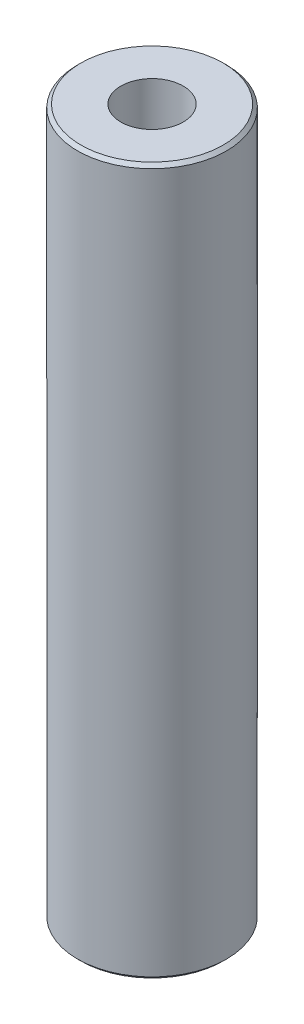
ISO-10303-21;
HEADER;
FILE_DESCRIPTION(('STEP AP214'),'2;1');
FILE_NAME('part.step','',(''),(''),'','','');
FILE_SCHEMA(('AUTOMOTIVE_DESIGN { 1 0 10303 214 1 1 1 1 }'));
ENDSEC;
DATA;
#1=APPLICATION_CONTEXT('core data for automotive mechanical design processes');
#2=APPLICATION_PROTOCOL_DEFINITION('international standard','automotive_design',2000,#1);
#3=PRODUCT_CONTEXT('',#1,'mechanical');
#4=PRODUCT('Part','Part','',(#3));
#5=PRODUCT_RELATED_PRODUCT_CATEGORY('part','',(#4));
#6=PRODUCT_DEFINITION_FORMATION('','',#4);
#7=PRODUCT_DEFINITION_CONTEXT('part definition',#1,'design');
#8=PRODUCT_DEFINITION('design','',#6,#7);
#9=PRODUCT_DEFINITION_SHAPE('','',#8);
#10=(LENGTH_UNIT() NAMED_UNIT(*) SI_UNIT(.MILLI.,.METRE.));
#11=(NAMED_UNIT(*) PLANE_ANGLE_UNIT() SI_UNIT($,.RADIAN.));
#12=(NAMED_UNIT(*) SI_UNIT($,.STERADIAN.) SOLID_ANGLE_UNIT());
#13=UNCERTAINTY_MEASURE_WITH_UNIT(LENGTH_MEASURE(1.E-05),#10,'distance_accuracy_value','');
#14=(GEOMETRIC_REPRESENTATION_CONTEXT(3) GLOBAL_UNCERTAINTY_ASSIGNED_CONTEXT((#13)) GLOBAL_UNIT_ASSIGNED_CONTEXT((#10,
#11,#12)) REPRESENTATION_CONTEXT('',''));
#15=CARTESIAN_POINT('',(0.,0.,0.));
#16=DIRECTION('',(0.,0.,1.));
#17=DIRECTION('',(1.,0.,0.));
#18=AXIS2_PLACEMENT_3D('',#15,#16,#17);
#19=CARTESIAN_POINT('',(0.,94.8356356416576,0.));
#20=DIRECTION('',(0.,-1.,0.));
#21=DIRECTION('',(0.,0.,-1.));
#22=AXIS2_PLACEMENT_3D('',#19,#20,#21);
#23=CYLINDRICAL_SURFACE('',#22,10.);
#24=CARTESIAN_POINT('',(0.,94.3852052418694,0.));
#25=DIRECTION('',(0.,1.,0.));
#26=DIRECTION('',(0.,0.,1.));
#27=AXIS2_PLACEMENT_3D('',#24,#25,#26);
#28=CIRCLE('',#27,10.);
#29=CARTESIAN_POINT('',(0.,94.3852052418694,-10.));
#30=VERTEX_POINT('',#29);
#31=EDGE_CURVE('E50',#30,#30,#28,.F.);
#32=CARTESIAN_POINT('',(0.,0.45043039978826,0.));
#33=DIRECTION('',(0.,1.,0.));
#34=DIRECTION('',(0.,0.,1.));
#35=AXIS2_PLACEMENT_3D('',#32,#33,#34);
#36=CIRCLE('',#35,10.);
#37=CARTESIAN_POINT('',(0.,0.45043039978826,-10.));
#38=VERTEX_POINT('',#37);
#39=EDGE_CURVE('E51',#38,#38,#36,.T.);
#40=CARTESIAN_POINT('',(0.,94.3852052418694,-10.));
#41=CARTESIAN_POINT('',(0.,93.406718003931,-10.));
#42=CARTESIAN_POINT('',(0.,92.4282307659927,-10.));
#43=CARTESIAN_POINT('',(0.,90.471256290116,-10.));
#44=CARTESIAN_POINT('',(0.,89.4927690521776,-10.));
#45=CARTESIAN_POINT('',(0.,87.5357945763009,-10.));
#46=CARTESIAN_POINT('',(0.,86.5573073383626,-10.));
#47=CARTESIAN_POINT('',(0.,84.6003328624859,-10.));
#48=CARTESIAN_POINT('',(0.,83.6218456245476,-10.));
#49=CARTESIAN_POINT('',(0.,81.6648711486709,-10.));
#50=CARTESIAN_POINT('',(0.,80.6863839107325,-10.));
#51=CARTESIAN_POINT('',(0.,78.7294094348558,-10.));
#52=CARTESIAN_POINT('',(0.,77.7509221969175,-10.));
#53=CARTESIAN_POINT('',(0.,75.7939477210408,-10.));
#54=CARTESIAN_POINT('',(0.,74.8154604831025,-10.));
#55=CARTESIAN_POINT('',(0.,72.8584860072258,-10.));
#56=CARTESIAN_POINT('',(0.,71.8799987692874,-10.));
#57=CARTESIAN_POINT('',(0.,69.9230242934107,-10.));
#58=CARTESIAN_POINT('',(0.,68.9445370554724,-10.));
#59=CARTESIAN_POINT('',(0.,66.9875625795957,-10.));
#60=CARTESIAN_POINT('',(0.,66.0090753416574,-10.));
#61=CARTESIAN_POINT('',(0.,64.0521008657807,-10.));
#62=CARTESIAN_POINT('',(0.,63.0736136278423,-10.));
#63=CARTESIAN_POINT('',(0.,61.1166391519656,-10.));
#64=CARTESIAN_POINT('',(0.,60.1381519140273,-10.));
#65=CARTESIAN_POINT('',(0.,58.1811774381506,-10.));
#66=CARTESIAN_POINT('',(0.,57.2026902002123,-10.));
#67=CARTESIAN_POINT('',(0.,55.2457157243356,-10.));
#68=CARTESIAN_POINT('',(0.,54.2672284863972,-10.));
#69=CARTESIAN_POINT('',(0.,52.3102540105205,-10.));
#70=CARTESIAN_POINT('',(0.,51.3317667725822,-10.));
#71=CARTESIAN_POINT('',(0.,49.3747922967055,-10.));
#72=CARTESIAN_POINT('',(0.,48.3963050587671,-10.));
#73=CARTESIAN_POINT('',(0.,46.4393305828905,-10.));
#74=CARTESIAN_POINT('',(0.,45.4608433449521,-10.));
#75=CARTESIAN_POINT('',(0.,43.5038688690754,-10.));
#76=CARTESIAN_POINT('',(0.,42.5253816311371,-10.));
#77=CARTESIAN_POINT('',(0.,40.5684071552604,-10.));
#78=CARTESIAN_POINT('',(0.,39.589919917322,-10.));
#79=CARTESIAN_POINT('',(0.,37.6329454414454,-10.));
#80=CARTESIAN_POINT('',(0.,36.654458203507,-10.));
#81=CARTESIAN_POINT('',(0.,34.6974837276303,-10.));
#82=CARTESIAN_POINT('',(0.,33.718996489692,-10.));
#83=CARTESIAN_POINT('',(0.,31.7620220138153,-10.));
#84=CARTESIAN_POINT('',(0.,30.7835347758769,-10.));
#85=CARTESIAN_POINT('',(0.,28.8265603000002,-10.));
#86=CARTESIAN_POINT('',(0.,27.8480730620619,-10.));
#87=CARTESIAN_POINT('',(0.,25.8910985861852,-10.));
#88=CARTESIAN_POINT('',(0.,24.9126113482469,-10.));
#89=CARTESIAN_POINT('',(0.,22.9556368723702,-10.));
#90=CARTESIAN_POINT('',(0.,21.9771496344319,-10.));
#91=CARTESIAN_POINT('',(0.,20.0201751585552,-10.));
#92=CARTESIAN_POINT('',(0.,19.0416879206168,-10.));
#93=CARTESIAN_POINT('',(0.,17.0847134447401,-10.));
#94=CARTESIAN_POINT('',(0.,16.1062262068018,-10.));
#95=CARTESIAN_POINT('',(0.,14.1492517309251,-10.));
#96=CARTESIAN_POINT('',(0.,13.1707644929867,-10.));
#97=CARTESIAN_POINT('',(0.,11.2137900171101,-10.));
#98=CARTESIAN_POINT('',(0.,10.2353027791717,-10.));
#99=CARTESIAN_POINT('',(0.,8.27832830329502,-10.));
#100=CARTESIAN_POINT('',(0.,7.29984106535668,-10.));
#101=CARTESIAN_POINT('',(0.,5.34286658947998,-10.));
#102=CARTESIAN_POINT('',(0.,4.36437935154164,-10.));
#103=CARTESIAN_POINT('',(0.,2.40740487566495,-10.));
#104=CARTESIAN_POINT('',(0.,1.42891763772661,-10.));
#105=CARTESIAN_POINT('',(0.,0.45043039978826,-10.));
#106=B_SPLINE_CURVE_WITH_KNOTS('',3,(#40,#41,#42,#43,#44,#45,#46,#47,#48,#49,#50,#51,#52,#53,
#54,#55,#56,#57,#58,#59,#60,#61,#62,#63,#64,#65,#66,#67,#68,#69,#70,#71,#72,#73,#74,#75,#76,#77,
#78,#79,#80,#81,#82,#83,#84,#85,#86,#87,#88,#89,#90,#91,#92,#93,#94,#95,#96,#97,#98,#99,#100,
#101,#102,#103,#104,#105),.UNSPECIFIED.,.F.,.F.,(4,2,2,2,2,2,2,2,2,2,2,2,2,2,2,2,2,2,2,2,2,2,2,
2,2,2,2,2,2,2,2,2,4),(0.,2.93546171381504,5.87092342763007,8.80638514144511,11.7418468552601,
14.6773085690752,17.6127702828902,20.5482319967052,23.4836937105203,26.4191554243353,
29.3546171381504,32.2900788519654,35.2255405657804,38.1610022795955,41.0964639934105,
44.0319257072255,46.9673874210406,49.9028491348556,52.8383108486706,55.7737725624857,
58.7092342763007,61.6446959901157,64.5801577039308,67.5156194177458,70.4510811315608,
73.3865428453759,76.3220045591909,79.2574662730059,82.192927986821,85.128389700636,
88.063851414451,90.9993131282661,93.9347748420811),.UNSPECIFIED.);
#107=EDGE_CURVE('BSEAM39',#30,#38,#106,.T.);
#108=ORIENTED_EDGE('',*,*,#31,.T.);
#109=ORIENTED_EDGE('',*,*,#39,.T.);
#110=ORIENTED_EDGE('',*,*,#107,.T.);
#111=ORIENTED_EDGE('',*,*,#107,.F.);
#112=EDGE_LOOP('',(#108,#110,#109,#111));
#113=FACE_BOUND('',#112,.T.);
#114=ADVANCED_FACE('F39',(#113),#23,.T.);
#115=CARTESIAN_POINT('',(0.,94.8356356416576,0.));
#116=DIRECTION('',(0.,1.,0.));
#117=DIRECTION('',(0.,0.,1.));
#118=AXIS2_PLACEMENT_3D('',#115,#116,#117);
#119=PLANE('',#118);
#120=CARTESIAN_POINT('',(0.,94.8356356416576,0.));
#121=DIRECTION('',(0.,1.,0.));
#122=DIRECTION('',(0.,0.,1.));
#123=AXIS2_PLACEMENT_3D('',#120,#121,#122);
#124=CIRCLE('',#123,9.54956960021175);
#125=CARTESIAN_POINT('',(0.,94.8356356416576,-9.54956960021176));
#126=VERTEX_POINT('',#125);
#127=EDGE_CURVE('E54',#126,#126,#124,.T.);
#128=ORIENTED_EDGE('',*,*,#127,.T.);
#129=EDGE_LOOP('',(#128));
#130=FACE_BOUND('',#129,.T.);
#131=CARTESIAN_POINT('',(0.,94.8356356416576,0.));
#132=DIRECTION('',(0.,1.,0.));
#133=DIRECTION('',(0.,0.,1.));
#134=AXIS2_PLACEMENT_3D('',#131,#132,#133);
#135=CIRCLE('',#134,4.18858633571735);
#136=CARTESIAN_POINT('',(0.,94.8356356416576,4.18858633571735));
#137=VERTEX_POINT('',#136);
#138=EDGE_CURVE('E58',#137,#137,#135,.T.);
#139=ORIENTED_EDGE('',*,*,#138,.F.);
#140=EDGE_LOOP('',(#139));
#141=FACE_BOUND('',#140,.T.);
#142=ADVANCED_FACE('F69',(#130,#141),#119,.T.);
#143=CARTESIAN_POINT('',(0.,0.,0.));
#144=DIRECTION('',(0.,1.,0.));
#145=DIRECTION('',(0.,0.,1.));
#146=AXIS2_PLACEMENT_3D('',#143,#144,#145);
#147=PLANE('',#146);
#148=CARTESIAN_POINT('',(0.,0.,0.));
#149=DIRECTION('',(0.,1.,0.));
#150=DIRECTION('',(0.,0.,1.));
#151=AXIS2_PLACEMENT_3D('',#148,#149,#150);
#152=CIRCLE('',#151,9.54956960021174);
#153=CARTESIAN_POINT('',(0.,0.,9.54956960021174));
#154=VERTEX_POINT('',#153);
#155=EDGE_CURVE('E10',#154,#154,#152,.F.);
#156=ORIENTED_EDGE('',*,*,#155,.T.);
#157=EDGE_LOOP('',(#156));
#158=FACE_BOUND('',#157,.T.);
#159=CARTESIAN_POINT('',(0.,0.,0.));
#160=DIRECTION('',(0.,1.,0.));
#161=DIRECTION('',(0.,0.,1.));
#162=AXIS2_PLACEMENT_3D('',#159,#160,#161);
#163=CIRCLE('',#162,4.18858633571735);
#164=CARTESIAN_POINT('',(0.,0.,4.18858633571735));
#165=VERTEX_POINT('',#164);
#166=EDGE_CURVE('E63',#165,#165,#163,.T.);
#167=ORIENTED_EDGE('',*,*,#166,.T.);
#168=EDGE_LOOP('',(#167));
#169=FACE_BOUND('',#168,.T.);
#170=ADVANCED_FACE('F75',(#158,#169),#147,.F.);
#171=CARTESIAN_POINT('',(0.,94.8356356416576,0.));
#172=DIRECTION('',(0.,-1.,0.));
#173=DIRECTION('',(0.,0.,-1.));
#174=AXIS2_PLACEMENT_3D('',#171,#172,#173);
#175=CYLINDRICAL_SURFACE('',#174,4.18858633571735);
#176=ORIENTED_EDGE('',*,*,#138,.T.);
#177=EDGE_LOOP('',(#176));
#178=FACE_BOUND('',#177,.T.);
#179=ORIENTED_EDGE('',*,*,#166,.F.);
#180=EDGE_LOOP('',(#179));
#181=FACE_BOUND('',#180,.T.);
#182=ADVANCED_FACE('F70',(#178,#181),#175,.F.);
#183=CARTESIAN_POINT('',(0.,94.8356356416576,0.));
#184=DIRECTION('',(0.,-1.,0.));
#185=DIRECTION('',(0.,0.,-1.));
#186=AXIS2_PLACEMENT_3D('',#183,#184,#185);
#187=CONICAL_SURFACE('',#186,9.54956960021175,0.785398163397439);
#188=CARTESIAN_POINT('',(0.,94.3852052418693,-10.));
#189=CARTESIAN_POINT('',(0.,94.3898972252005,-9.99530801666888));
#190=CARTESIAN_POINT('',(0.,94.3945892085316,-9.99061603333775));
#191=CARTESIAN_POINT('',(0.,94.4039731751939,-9.9812320666755));
#192=CARTESIAN_POINT('',(0.,94.408665158525,-9.97654008334437));
#193=CARTESIAN_POINT('',(0.,94.4180491251872,-9.96715611668211));
#194=CARTESIAN_POINT('',(0.,94.4227411085184,-9.96246413335099));
#195=CARTESIAN_POINT('',(0.,94.4321250751806,-9.95308016668873));
#196=CARTESIAN_POINT('',(0.,94.4368170585118,-9.9483881833576));
#197=CARTESIAN_POINT('',(0.,94.446201025174,-9.93900421669535));
#198=CARTESIAN_POINT('',(0.,94.4508930085051,-9.93431223336422));
#199=CARTESIAN_POINT('',(0.,94.4602769751674,-9.92492826670196));
#200=CARTESIAN_POINT('',(0.,94.4649689584985,-9.92023628337084));
#201=CARTESIAN_POINT('',(0.,94.4743529251608,-9.91085231670858));
#202=CARTESIAN_POINT('',(0.,94.4790449084919,-9.90616033337746));
#203=CARTESIAN_POINT('',(0.,94.4884288751542,-9.8967763667152));
#204=CARTESIAN_POINT('',(0.,94.4931208584853,-9.89208438338407));
#205=CARTESIAN_POINT('',(0.,94.5025048251475,-9.88270041672182));
#206=CARTESIAN_POINT('',(0.,94.5071968084787,-9.87800843339069));
#207=CARTESIAN_POINT('',(0.,94.5165807751409,-9.86862446672843));
#208=CARTESIAN_POINT('',(0.,94.5212727584721,-9.8639324833973));
#209=CARTESIAN_POINT('',(0.,94.5306567251343,-9.85454851673505));
#210=CARTESIAN_POINT('',(0.,94.5353487084654,-9.84985653340392));
#211=CARTESIAN_POINT('',(0.,94.5447326751277,-9.84047256674167));
#212=CARTESIAN_POINT('',(0.,94.5494246584588,-9.83578058341054));
#213=CARTESIAN_POINT('',(0.,94.5588086251211,-9.82639661674829));
#214=CARTESIAN_POINT('',(0.,94.5635006084522,-9.82170463341716));
#215=CARTESIAN_POINT('',(0.,94.5728845751145,-9.8123206667549));
#216=CARTESIAN_POINT('',(0.,94.5775765584456,-9.80762868342378));
#217=CARTESIAN_POINT('',(0.,94.5869605251078,-9.79824471676152));
#218=CARTESIAN_POINT('',(0.,94.591652508439,-9.79355273343039));
#219=CARTESIAN_POINT('',(0.,94.6010364751012,-9.78416876676814));
#220=CARTESIAN_POINT('',(0.,94.6057284584324,-9.77947678343701));
#221=CARTESIAN_POINT('',(0.,94.6151124250946,-9.77009281677475));
#222=CARTESIAN_POINT('',(0.,94.6198044084257,-9.76540083344363));
#223=CARTESIAN_POINT('',(0.,94.629188375088,-9.75601686678137));
#224=CARTESIAN_POINT('',(0.,94.6338803584191,-9.75132488345024));
#225=CARTESIAN_POINT('',(0.,94.6432643250814,-9.74194091678799));
#226=CARTESIAN_POINT('',(0.,94.6479563084125,-9.73724893345686));
#227=CARTESIAN_POINT('',(0.,94.6573402750748,-9.72786496679461));
#228=CARTESIAN_POINT('',(0.,94.6620322584059,-9.72317298346348));
#229=CARTESIAN_POINT('',(0.,94.6714162250681,-9.71378901680122));
#230=CARTESIAN_POINT('',(0.,94.6761082083993,-9.70909703347009));
#231=CARTESIAN_POINT('',(0.,94.6854921750615,-9.69971306680784));
#232=CARTESIAN_POINT('',(0.,94.6901841583927,-9.69502108347671));
#233=CARTESIAN_POINT('',(0.,94.6995681250549,-9.68563711681446));
#234=CARTESIAN_POINT('',(0.,94.704260108386,-9.68094513348333));
#235=CARTESIAN_POINT('',(0.,94.7136440750483,-9.67156116682107));
#236=CARTESIAN_POINT('',(0.,94.7183360583794,-9.66686918348995));
#237=CARTESIAN_POINT('',(0.,94.7277200250417,-9.65748521682769));
#238=CARTESIAN_POINT('',(0.,94.7324120083728,-9.65279323349656));
#239=CARTESIAN_POINT('',(0.,94.7417959750351,-9.64340926683431));
#240=CARTESIAN_POINT('',(0.,94.7464879583662,-9.63871728350318));
#241=CARTESIAN_POINT('',(0.,94.7558719250284,-9.62933331684093));
#242=CARTESIAN_POINT('',(0.,94.7605639083596,-9.6246413335098));
#243=CARTESIAN_POINT('',(0.,94.7699478750218,-9.61525736684754));
#244=CARTESIAN_POINT('',(0.,94.774639858353,-9.61056538351641));
#245=CARTESIAN_POINT('',(0.,94.7840238250152,-9.60118141685416));
#246=CARTESIAN_POINT('',(0.,94.7887158083463,-9.59648943352303));
#247=CARTESIAN_POINT('',(0.,94.7980997750086,-9.58710546686078));
#248=CARTESIAN_POINT('',(0.,94.8027917583397,-9.58241348352965));
#249=CARTESIAN_POINT('',(0.,94.812175725002,-9.5730295168674));
#250=CARTESIAN_POINT('',(0.,94.8168677083331,-9.56833753353627));
#251=CARTESIAN_POINT('',(0.,94.8262516749953,-9.55895356687401));
#252=CARTESIAN_POINT('',(0.,94.8309436583265,-9.55426158354288));
#253=CARTESIAN_POINT('',(0.,94.8356356416576,-9.54956960021176));
#254=B_SPLINE_CURVE_WITH_KNOTS('',3,(#188,#189,#190,#191,#192,#193,#194,#195,#196,#197,#198,
#199,#200,#201,#202,#203,#204,#205,#206,#207,#208,#209,#210,#211,#212,#213,#214,#215,#216,#217,
#218,#219,#220,#221,#222,#223,#224,#225,#226,#227,#228,#229,#230,#231,#232,#233,#234,#235,#236,
#237,#238,#239,#240,#241,#242,#243,#244,#245,#246,#247,#248,#249,#250,#251,#252,#253),
.UNSPECIFIED.,.F.,.F.,(4,2,2,2,2,2,2,2,2,2,2,2,2,2,2,2,2,2,2,2,2,2,2,2,2,2,2,2,2,2,2,2,4),(0.,
0.019906399383934,0.0398127987678582,0.059719198151791,0.0796255975357152,0.0995319969196394,
0.119438396303573,0.139344795687498,0.159251195071422,0.179157594455356,0.199063993839279,
0.218970393223213,0.238876792607137,0.258783191991061,0.278689591374995,0.298595990758919,
0.318502390142842,0.338408789526776,0.358315188910701,0.378221588294635,0.398127987678559,
0.418034387062483,0.437940786446417,0.45784718583034,0.477753585214274,0.497659984598198,
0.517566383982122,0.537472783366056,0.557379182749981,0.577285582133904,0.597191981517838,
0.617098380901762,0.637004780285696),.UNSPECIFIED.);
#255=EDGE_CURVE('BSEAM81',#30,#126,#254,.T.);
#256=ORIENTED_EDGE('',*,*,#31,.F.);
#257=ORIENTED_EDGE('',*,*,#127,.F.);
#258=ORIENTED_EDGE('',*,*,#255,.T.);
#259=ORIENTED_EDGE('',*,*,#255,.F.);
#260=EDGE_LOOP('',(#256,#258,#257,#259));
#261=FACE_BOUND('',#260,.T.);
#262=ADVANCED_FACE('F81',(#261),#187,.T.);
#263=CARTESIAN_POINT('',(0.,0.45043039978826,0.));
#264=DIRECTION('',(0.,1.,0.));
#265=DIRECTION('',(0.,0.,1.));
#266=AXIS2_PLACEMENT_3D('',#263,#264,#265);
#267=CONICAL_SURFACE('',#266,10.,0.785398163397446);
#268=ORIENTED_EDGE('',*,*,#155,.F.);
#269=EDGE_LOOP('',(#268));
#270=FACE_BOUND('',#269,.T.);
#271=ORIENTED_EDGE('',*,*,#39,.F.);
#272=EDGE_LOOP('',(#271));
#273=FACE_BOUND('',#272,.T.);
#274=ADVANCED_FACE('F45',(#270,#273),#267,.T.);
#275=CLOSED_SHELL('',(#114,#142,#170,#182,#262,#274));
#276=MANIFOLD_SOLID_BREP('B2',#275);
#277=ADVANCED_BREP_SHAPE_REPRESENTATION('',(#18,#276),#14);
#278=SHAPE_DEFINITION_REPRESENTATION(#9,#277);
ENDSEC;
END-ISO-10303-21;
